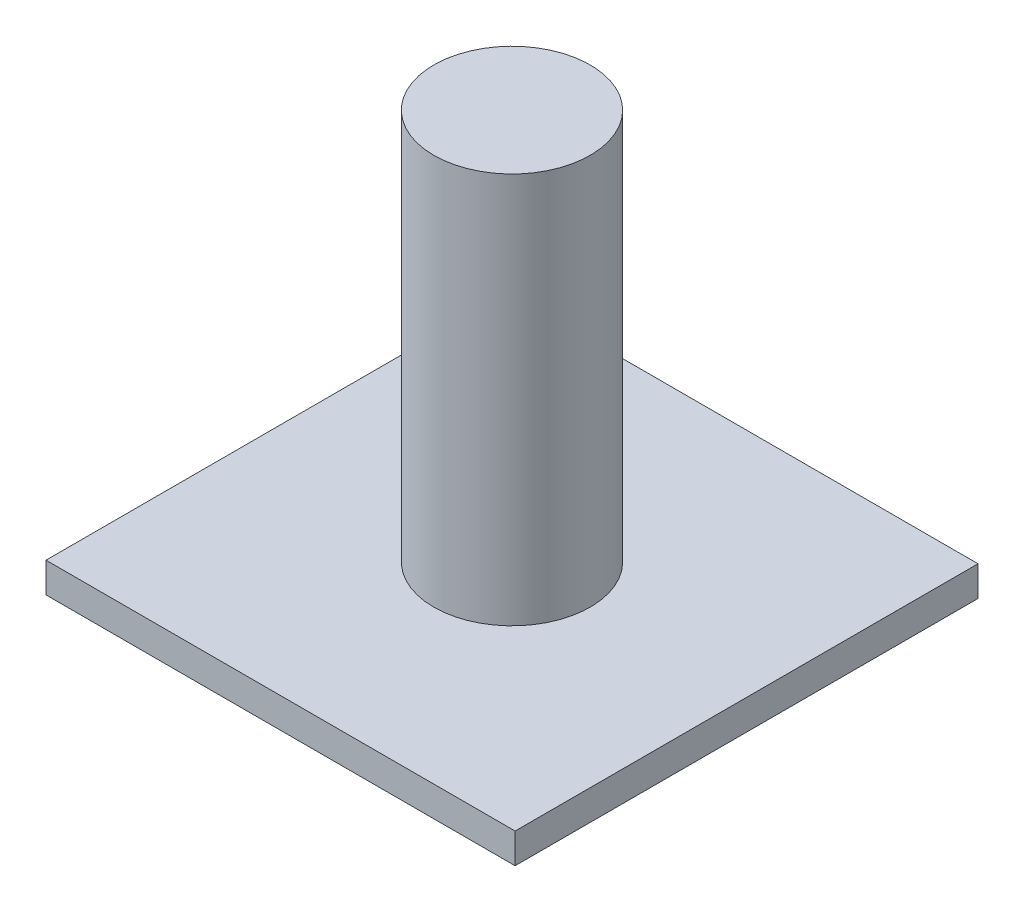
ISO-10303-21;
HEADER;
FILE_DESCRIPTION(('STEP AP214'),'2;1');
FILE_NAME('part.step','',(''),(''),'','','');
FILE_SCHEMA(('AUTOMOTIVE_DESIGN { 1 0 10303 214 1 1 1 1 }'));
ENDSEC;
DATA;
#1=APPLICATION_CONTEXT('core data for automotive mechanical design processes');
#2=APPLICATION_PROTOCOL_DEFINITION('international standard','automotive_design',2000,#1);
#3=PRODUCT_CONTEXT('',#1,'mechanical');
#4=PRODUCT('Part','Part','',(#3));
#5=PRODUCT_RELATED_PRODUCT_CATEGORY('part','',(#4));
#6=PRODUCT_DEFINITION_FORMATION('','',#4);
#7=PRODUCT_DEFINITION_CONTEXT('part definition',#1,'design');
#8=PRODUCT_DEFINITION('design','',#6,#7);
#9=PRODUCT_DEFINITION_SHAPE('','',#8);
#10=(LENGTH_UNIT() NAMED_UNIT(*) SI_UNIT(.MILLI.,.METRE.));
#11=(NAMED_UNIT(*) PLANE_ANGLE_UNIT() SI_UNIT($,.RADIAN.));
#12=(NAMED_UNIT(*) SI_UNIT($,.STERADIAN.) SOLID_ANGLE_UNIT());
#13=UNCERTAINTY_MEASURE_WITH_UNIT(LENGTH_MEASURE(1.E-05),#10,'distance_accuracy_value','');
#14=(GEOMETRIC_REPRESENTATION_CONTEXT(3) GLOBAL_UNCERTAINTY_ASSIGNED_CONTEXT((#13)) GLOBAL_UNIT_ASSIGNED_CONTEXT((#10,
#11,#12)) REPRESENTATION_CONTEXT('',''));
#15=CARTESIAN_POINT('',(0.,0.,0.));
#16=DIRECTION('',(0.,0.,1.));
#17=DIRECTION('',(1.,0.,0.));
#18=AXIS2_PLACEMENT_3D('',#15,#16,#17);
#19=CARTESIAN_POINT('',(38.9621770533312,5.,38.4461217281215));
#20=DIRECTION('',(-1.,0.,0.));
#21=DIRECTION('',(0.,0.,1.));
#22=AXIS2_PLACEMENT_3D('',#19,#20,#21);
#23=PLANE('',#22);
#24=DIRECTION('',(0.,0.,-1.));
#25=VECTOR('',#24,1.);
#26=CARTESIAN_POINT('',(38.9621770533312,0.,38.4461217281215));
#27=LINE('',#26,#25);
#28=CARTESIAN_POINT('',(38.9621770533312,0.,38.4461217281215));
#29=VERTEX_POINT('',#28);
#30=CARTESIAN_POINT('',(38.9621770533312,0.,-38.4461217281215));
#31=VERTEX_POINT('',#30);
#32=EDGE_CURVE('E110',#29,#31,#27,.T.);
#33=ORIENTED_EDGE('',*,*,#32,.T.);
#34=DIRECTION('',(0.,-1.,0.));
#35=VECTOR('',#34,1.);
#36=CARTESIAN_POINT('',(38.9621770533312,5.,-38.4461217281215));
#37=LINE('',#36,#35);
#38=CARTESIAN_POINT('',(38.9621770533312,5.,-38.4461217281215));
#39=VERTEX_POINT('',#38);
#40=EDGE_CURVE('E42',#39,#31,#37,.T.);
#41=ORIENTED_EDGE('',*,*,#40,.F.);
#42=DIRECTION('',(0.,0.,-1.));
#43=VECTOR('',#42,1.);
#44=CARTESIAN_POINT('',(38.9621770533312,5.,38.4461217281215));
#45=LINE('',#44,#43);
#46=CARTESIAN_POINT('',(38.9621770533312,5.,38.4461217281215));
#47=VERTEX_POINT('',#46);
#48=EDGE_CURVE('E93',#47,#39,#45,.T.);
#49=ORIENTED_EDGE('',*,*,#48,.F.);
#50=DIRECTION('',(0.,-1.,0.));
#51=VECTOR('',#50,1.);
#52=CARTESIAN_POINT('',(38.9621770533312,5.,38.4461217281215));
#53=LINE('',#52,#51);
#54=EDGE_CURVE('E106',#47,#29,#53,.T.);
#55=ORIENTED_EDGE('',*,*,#54,.T.);
#56=EDGE_LOOP('',(#33,#41,#49,#55));
#57=FACE_BOUND('',#56,.T.);
#58=ADVANCED_FACE('F39',(#57),#23,.F.);
#59=CARTESIAN_POINT('',(-38.9621770533312,5.,-38.4461217281215));
#60=DIRECTION('',(0.,0.,1.));
#61=DIRECTION('',(1.,0.,0.));
#62=AXIS2_PLACEMENT_3D('',#59,#60,#61);
#63=PLANE('',#62);
#64=DIRECTION('',(-1.,0.,0.));
#65=VECTOR('',#64,1.);
#66=CARTESIAN_POINT('',(-38.9621770533312,0.,-38.4461217281215));
#67=LINE('',#66,#65);
#68=CARTESIAN_POINT('',(-38.9621770533312,0.,-38.4461217281215));
#69=VERTEX_POINT('',#68);
#70=EDGE_CURVE('E99',#31,#69,#67,.T.);
#71=ORIENTED_EDGE('',*,*,#70,.T.);
#72=DIRECTION('',(0.,-1.,0.));
#73=VECTOR('',#72,1.);
#74=CARTESIAN_POINT('',(-38.9621770533312,5.,-38.4461217281215));
#75=LINE('',#74,#73);
#76=CARTESIAN_POINT('',(-38.9621770533312,5.,-38.4461217281215));
#77=VERTEX_POINT('',#76);
#78=EDGE_CURVE('E97',#77,#69,#75,.T.);
#79=ORIENTED_EDGE('',*,*,#78,.F.);
#80=DIRECTION('',(-1.,0.,0.));
#81=VECTOR('',#80,1.);
#82=CARTESIAN_POINT('',(-38.9621770533312,5.,-38.4461217281215));
#83=LINE('',#82,#81);
#84=EDGE_CURVE('E88',#39,#77,#83,.T.);
#85=ORIENTED_EDGE('',*,*,#84,.F.);
#86=ORIENTED_EDGE('',*,*,#40,.T.);
#87=EDGE_LOOP('',(#71,#79,#85,#86));
#88=FACE_BOUND('',#87,.T.);
#89=ADVANCED_FACE('F98',(#88),#63,.F.);
#90=CARTESIAN_POINT('',(-38.9621770533312,5.,38.4461217281215));
#91=DIRECTION('',(1.,0.,0.));
#92=DIRECTION('',(0.,0.,-1.));
#93=AXIS2_PLACEMENT_3D('',#90,#91,#92);
#94=PLANE('',#93);
#95=DIRECTION('',(0.,0.,1.));
#96=VECTOR('',#95,1.);
#97=CARTESIAN_POINT('',(-38.9621770533312,0.,38.4461217281215));
#98=LINE('',#97,#96);
#99=CARTESIAN_POINT('',(-38.9621770533312,0.,38.4461217281215));
#100=VERTEX_POINT('',#99);
#101=EDGE_CURVE('E74',#69,#100,#98,.T.);
#102=ORIENTED_EDGE('',*,*,#101,.T.);
#103=DIRECTION('',(0.,-1.,0.));
#104=VECTOR('',#103,1.);
#105=CARTESIAN_POINT('',(-38.9621770533312,5.,38.4461217281215));
#106=LINE('',#105,#104);
#107=CARTESIAN_POINT('',(-38.9621770533312,5.,38.4461217281215));
#108=VERTEX_POINT('',#107);
#109=EDGE_CURVE('E101',#108,#100,#106,.T.);
#110=ORIENTED_EDGE('',*,*,#109,.F.);
#111=DIRECTION('',(0.,0.,1.));
#112=VECTOR('',#111,1.);
#113=CARTESIAN_POINT('',(-38.9621770533312,5.,38.4461217281215));
#114=LINE('',#113,#112);
#115=EDGE_CURVE('E91',#77,#108,#114,.T.);
#116=ORIENTED_EDGE('',*,*,#115,.F.);
#117=ORIENTED_EDGE('',*,*,#78,.T.);
#118=EDGE_LOOP('',(#102,#110,#116,#117));
#119=FACE_BOUND('',#118,.T.);
#120=ADVANCED_FACE('F102',(#119),#94,.F.);
#121=CARTESIAN_POINT('',(-38.9621770533312,5.,38.4461217281215));
#122=DIRECTION('',(0.,0.,-1.));
#123=DIRECTION('',(-1.,0.,0.));
#124=AXIS2_PLACEMENT_3D('',#121,#122,#123);
#125=PLANE('',#124);
#126=DIRECTION('',(1.,0.,0.));
#127=VECTOR('',#126,1.);
#128=CARTESIAN_POINT('',(-38.9621770533312,0.,38.4461217281215));
#129=LINE('',#128,#127);
#130=EDGE_CURVE('E80',#100,#29,#129,.T.);
#131=ORIENTED_EDGE('',*,*,#130,.T.);
#132=ORIENTED_EDGE('',*,*,#54,.F.);
#133=DIRECTION('',(1.,0.,0.));
#134=VECTOR('',#133,1.);
#135=CARTESIAN_POINT('',(-38.9621770533312,5.,38.4461217281215));
#136=LINE('',#135,#134);
#137=EDGE_CURVE('E57',#108,#47,#136,.T.);
#138=ORIENTED_EDGE('',*,*,#137,.F.);
#139=ORIENTED_EDGE('',*,*,#109,.T.);
#140=EDGE_LOOP('',(#131,#132,#138,#139));
#141=FACE_BOUND('',#140,.T.);
#142=ADVANCED_FACE('F124',(#141),#125,.F.);
#143=CARTESIAN_POINT('',(0.,5.,0.));
#144=DIRECTION('',(0.,-1.,0.));
#145=DIRECTION('',(0.,0.,-1.));
#146=AXIS2_PLACEMENT_3D('',#143,#144,#145);
#147=PLANE('',#146);
#148=CARTESIAN_POINT('',(0.,5.,0.));
#149=DIRECTION('',(0.,1.,0.));
#150=DIRECTION('',(0.,0.,1.));
#151=AXIS2_PLACEMENT_3D('',#148,#149,#150);
#152=CIRCLE('',#151,13.);
#153=CARTESIAN_POINT('',(0.,5.,13.));
#154=VERTEX_POINT('',#153);
#155=EDGE_CURVE('E11',#154,#154,#152,.T.);
#156=ORIENTED_EDGE('',*,*,#155,.F.);
#157=EDGE_LOOP('',(#156));
#158=FACE_BOUND('',#157,.T.);
#159=ORIENTED_EDGE('',*,*,#48,.T.);
#160=ORIENTED_EDGE('',*,*,#84,.T.);
#161=ORIENTED_EDGE('',*,*,#115,.T.);
#162=ORIENTED_EDGE('',*,*,#137,.T.);
#163=EDGE_LOOP('',(#159,#160,#161,#162));
#164=FACE_BOUND('',#163,.T.);
#165=ADVANCED_FACE('F89',(#158,#164),#147,.F.);
#166=CARTESIAN_POINT('',(0.,0.,0.));
#167=DIRECTION('',(0.,-1.,0.));
#168=DIRECTION('',(0.,0.,-1.));
#169=AXIS2_PLACEMENT_3D('',#166,#167,#168);
#170=PLANE('',#169);
#171=ORIENTED_EDGE('',*,*,#32,.F.);
#172=ORIENTED_EDGE('',*,*,#130,.F.);
#173=ORIENTED_EDGE('',*,*,#101,.F.);
#174=ORIENTED_EDGE('',*,*,#70,.F.);
#175=EDGE_LOOP('',(#171,#172,#173,#174));
#176=FACE_BOUND('',#175,.T.);
#177=ADVANCED_FACE('F127',(#176),#170,.T.);
#178=CARTESIAN_POINT('',(0.,70.,0.));
#179=DIRECTION('',(0.,-1.,0.));
#180=DIRECTION('',(0.,0.,-1.));
#181=AXIS2_PLACEMENT_3D('',#178,#179,#180);
#182=CYLINDRICAL_SURFACE('',#181,13.);
#183=CARTESIAN_POINT('',(0.,70.,0.));
#184=DIRECTION('',(0.,1.,0.));
#185=DIRECTION('',(0.,0.,1.));
#186=AXIS2_PLACEMENT_3D('',#183,#184,#185);
#187=CIRCLE('',#186,13.);
#188=CARTESIAN_POINT('',(0.,70.,13.));
#189=VERTEX_POINT('',#188);
#190=EDGE_CURVE('E114',#189,#189,#187,.T.);
#191=ORIENTED_EDGE('',*,*,#190,.F.);
#192=EDGE_LOOP('',(#191));
#193=FACE_BOUND('',#192,.T.);
#194=ORIENTED_EDGE('',*,*,#155,.T.);
#195=EDGE_LOOP('',(#194));
#196=FACE_BOUND('',#195,.T.);
#197=ADVANCED_FACE('F137',(#193,#196),#182,.T.);
#198=CARTESIAN_POINT('',(0.,70.,0.));
#199=DIRECTION('',(0.,1.,0.));
#200=DIRECTION('',(0.,0.,1.));
#201=AXIS2_PLACEMENT_3D('',#198,#199,#200);
#202=PLANE('',#201);
#203=ORIENTED_EDGE('',*,*,#190,.T.);
#204=EDGE_LOOP('',(#203));
#205=FACE_BOUND('',#204,.T.);
#206=ADVANCED_FACE('F135',(#205),#202,.T.);
#207=CLOSED_SHELL('',(#58,#89,#120,#142,#165,#177,#197,#206));
#208=MANIFOLD_SOLID_BREP('B2',#207);
#209=ADVANCED_BREP_SHAPE_REPRESENTATION('',(#18,#208),#14);
#210=SHAPE_DEFINITION_REPRESENTATION(#9,#209);
ENDSEC;
END-ISO-10303-21;
